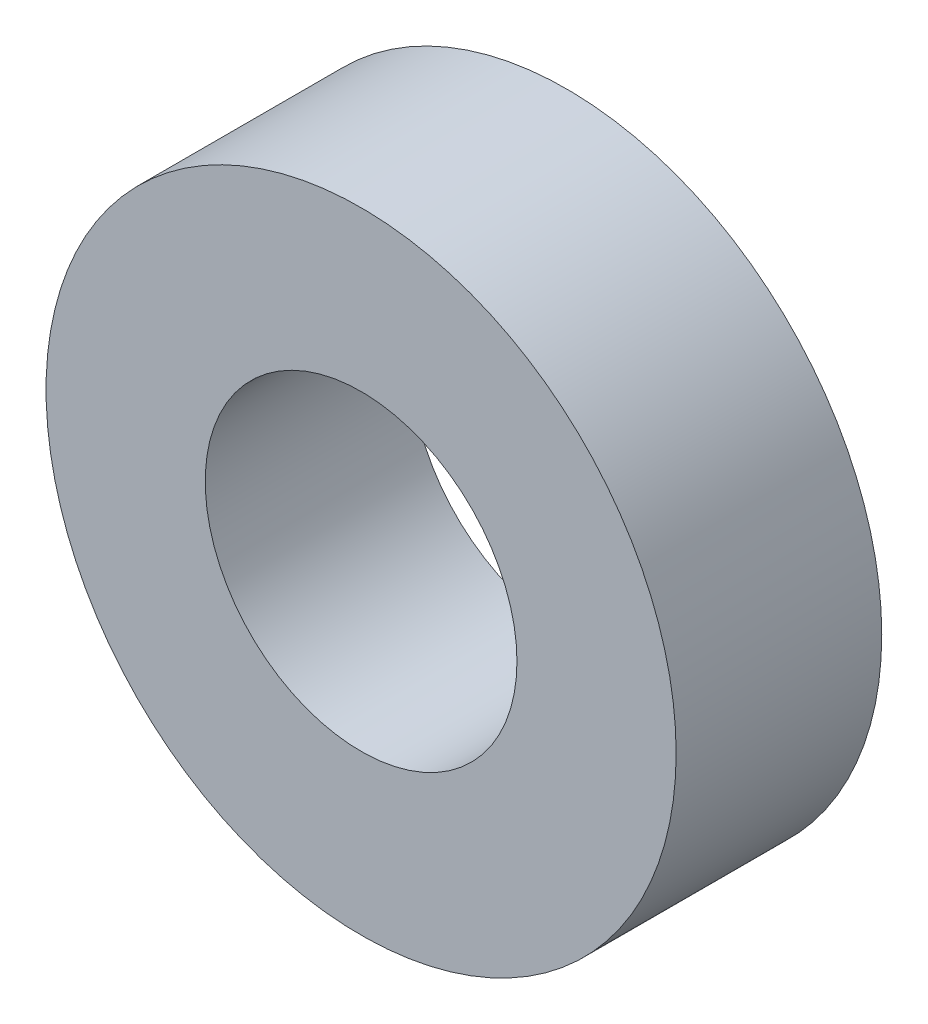
ISO-10303-21;
HEADER;
FILE_DESCRIPTION(('STEP AP214'),'2;1');
FILE_NAME('part.step','',(''),(''),'','','');
FILE_SCHEMA(('AUTOMOTIVE_DESIGN { 1 0 10303 214 1 1 1 1 }'));
ENDSEC;
DATA;
#1=APPLICATION_CONTEXT('core data for automotive mechanical design processes');
#2=APPLICATION_PROTOCOL_DEFINITION('international standard','automotive_design',2000,#1);
#3=PRODUCT_CONTEXT('',#1,'mechanical');
#4=PRODUCT('Part','Part','',(#3));
#5=PRODUCT_RELATED_PRODUCT_CATEGORY('part','',(#4));
#6=PRODUCT_DEFINITION_FORMATION('','',#4);
#7=PRODUCT_DEFINITION_CONTEXT('part definition',#1,'design');
#8=PRODUCT_DEFINITION('design','',#6,#7);
#9=PRODUCT_DEFINITION_SHAPE('','',#8);
#10=(LENGTH_UNIT() NAMED_UNIT(*) SI_UNIT(.MILLI.,.METRE.));
#11=(NAMED_UNIT(*) PLANE_ANGLE_UNIT() SI_UNIT($,.RADIAN.));
#12=(NAMED_UNIT(*) SI_UNIT($,.STERADIAN.) SOLID_ANGLE_UNIT());
#13=UNCERTAINTY_MEASURE_WITH_UNIT(LENGTH_MEASURE(1.E-05),#10,'distance_accuracy_value','');
#14=(GEOMETRIC_REPRESENTATION_CONTEXT(3) GLOBAL_UNCERTAINTY_ASSIGNED_CONTEXT((#13)) GLOBAL_UNIT_ASSIGNED_CONTEXT((#10,
#11,#12)) REPRESENTATION_CONTEXT('',''));
#15=CARTESIAN_POINT('',(0.,0.,0.));
#16=DIRECTION('',(0.,0.,1.));
#17=DIRECTION('',(1.,0.,0.));
#18=AXIS2_PLACEMENT_3D('',#15,#16,#17);
#19=CARTESIAN_POINT('',(0.,0.,-1.55));
#20=DIRECTION('',(0.,0.,1.));
#21=DIRECTION('',(1.,0.,0.));
#22=AXIS2_PLACEMENT_3D('',#19,#20,#21);
#23=CYLINDRICAL_SURFACE('',#22,4.75);
#24=CARTESIAN_POINT('',(0.,0.,-1.55));
#25=DIRECTION('',(0.,0.,1.));
#26=DIRECTION('',(1.,0.,0.));
#27=AXIS2_PLACEMENT_3D('',#24,#25,#26);
#28=CIRCLE('',#27,4.75);
#29=CARTESIAN_POINT('',(4.75,0.,-1.55));
#30=VERTEX_POINT('',#29);
#31=EDGE_CURVE('E9',#30,#30,#28,.T.);
#32=ORIENTED_EDGE('',*,*,#31,.T.);
#33=EDGE_LOOP('',(#32));
#34=FACE_BOUND('',#33,.T.);
#35=CARTESIAN_POINT('',(0.,0.,1.55));
#36=DIRECTION('',(0.,0.,1.));
#37=DIRECTION('',(1.,0.,0.));
#38=AXIS2_PLACEMENT_3D('',#35,#36,#37);
#39=CIRCLE('',#38,4.75);
#40=CARTESIAN_POINT('',(4.75,0.,1.55));
#41=VERTEX_POINT('',#40);
#42=EDGE_CURVE('E17',#41,#41,#39,.T.);
#43=ORIENTED_EDGE('',*,*,#42,.F.);
#44=EDGE_LOOP('',(#43));
#45=FACE_BOUND('',#44,.T.);
#46=ADVANCED_FACE('F14',(#34,#45),#23,.T.);
#47=CARTESIAN_POINT('',(0.,0.,-1.55));
#48=DIRECTION('',(0.,0.,1.));
#49=DIRECTION('',(1.,0.,0.));
#50=AXIS2_PLACEMENT_3D('',#47,#48,#49);
#51=PLANE('',#50);
#52=CARTESIAN_POINT('',(0.,0.,-1.55));
#53=DIRECTION('',(0.,0.,1.));
#54=DIRECTION('',(1.,0.,0.));
#55=AXIS2_PLACEMENT_3D('',#52,#53,#54);
#56=CIRCLE('',#55,2.35);
#57=CARTESIAN_POINT('',(2.35,0.,-1.55));
#58=VERTEX_POINT('',#57);
#59=EDGE_CURVE('E33',#58,#58,#56,.T.);
#60=ORIENTED_EDGE('',*,*,#59,.T.);
#61=EDGE_LOOP('',(#60));
#62=FACE_BOUND('',#61,.T.);
#63=ORIENTED_EDGE('',*,*,#31,.F.);
#64=EDGE_LOOP('',(#63));
#65=FACE_BOUND('',#64,.T.);
#66=ADVANCED_FACE('F42',(#62,#65),#51,.F.);
#67=CARTESIAN_POINT('',(0.,0.,1.55));
#68=DIRECTION('',(0.,0.,1.));
#69=DIRECTION('',(1.,0.,0.));
#70=AXIS2_PLACEMENT_3D('',#67,#68,#69);
#71=PLANE('',#70);
#72=CARTESIAN_POINT('',(0.,0.,1.55));
#73=DIRECTION('',(0.,0.,1.));
#74=DIRECTION('',(1.,0.,0.));
#75=AXIS2_PLACEMENT_3D('',#72,#73,#74);
#76=CIRCLE('',#75,2.35);
#77=CARTESIAN_POINT('',(2.35,0.,1.55));
#78=VERTEX_POINT('',#77);
#79=EDGE_CURVE('E28',#78,#78,#76,.T.);
#80=ORIENTED_EDGE('',*,*,#79,.F.);
#81=EDGE_LOOP('',(#80));
#82=FACE_BOUND('',#81,.T.);
#83=ORIENTED_EDGE('',*,*,#42,.T.);
#84=EDGE_LOOP('',(#83));
#85=FACE_BOUND('',#84,.T.);
#86=ADVANCED_FACE('F48',(#82,#85),#71,.T.);
#87=CARTESIAN_POINT('',(0.,0.,-1.55));
#88=DIRECTION('',(0.,0.,1.));
#89=DIRECTION('',(1.,0.,0.));
#90=AXIS2_PLACEMENT_3D('',#87,#88,#89);
#91=CYLINDRICAL_SURFACE('',#90,2.35);
#92=ORIENTED_EDGE('',*,*,#59,.F.);
#93=EDGE_LOOP('',(#92));
#94=FACE_BOUND('',#93,.T.);
#95=ORIENTED_EDGE('',*,*,#79,.T.);
#96=EDGE_LOOP('',(#95));
#97=FACE_BOUND('',#96,.T.);
#98=ADVANCED_FACE('F45',(#94,#97),#91,.F.);
#99=CLOSED_SHELL('',(#46,#66,#86,#98));
#100=MANIFOLD_SOLID_BREP('B1',#99);
#101=ADVANCED_BREP_SHAPE_REPRESENTATION('',(#18,#100),#14);
#102=SHAPE_DEFINITION_REPRESENTATION(#9,#101);
ENDSEC;
END-ISO-10303-21;
